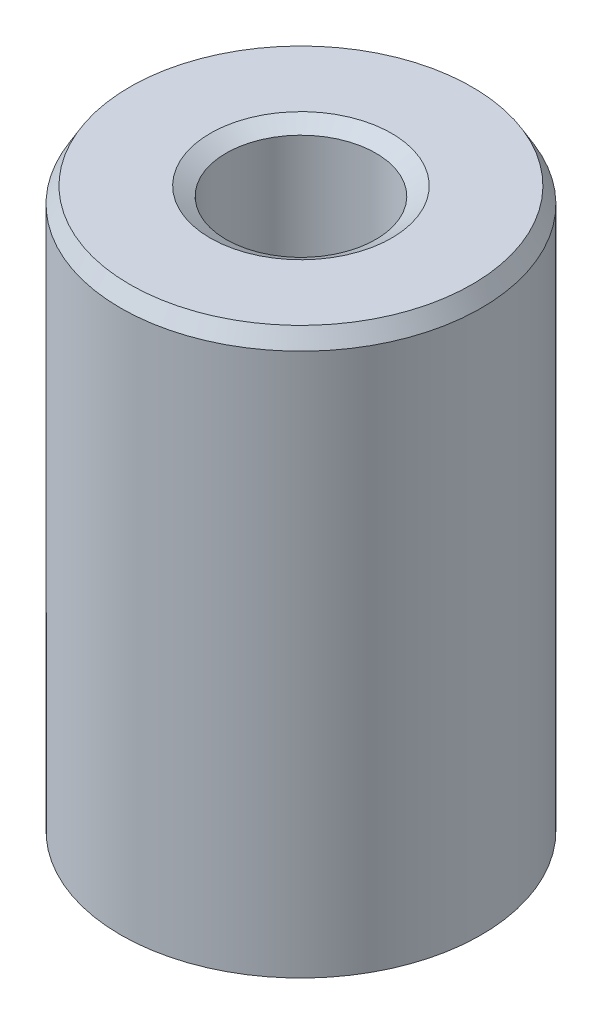
ISO-10303-21;
HEADER;
FILE_DESCRIPTION(('STEP AP214'),'2;1');
FILE_NAME('part.step','',(''),(''),'','','');
FILE_SCHEMA(('AUTOMOTIVE_DESIGN { 1 0 10303 214 1 1 1 1 }'));
ENDSEC;
DATA;
#1=APPLICATION_CONTEXT('core data for automotive mechanical design processes');
#2=APPLICATION_PROTOCOL_DEFINITION('international standard','automotive_design',2000,#1);
#3=PRODUCT_CONTEXT('',#1,'mechanical');
#4=PRODUCT('Part','Part','',(#3));
#5=PRODUCT_RELATED_PRODUCT_CATEGORY('part','',(#4));
#6=PRODUCT_DEFINITION_FORMATION('','',#4);
#7=PRODUCT_DEFINITION_CONTEXT('part definition',#1,'design');
#8=PRODUCT_DEFINITION('design','',#6,#7);
#9=PRODUCT_DEFINITION_SHAPE('','',#8);
#10=(LENGTH_UNIT() NAMED_UNIT(*) SI_UNIT(.MILLI.,.METRE.));
#11=(NAMED_UNIT(*) PLANE_ANGLE_UNIT() SI_UNIT($,.RADIAN.));
#12=(NAMED_UNIT(*) SI_UNIT($,.STERADIAN.) SOLID_ANGLE_UNIT());
#13=UNCERTAINTY_MEASURE_WITH_UNIT(LENGTH_MEASURE(1.E-05),#10,'distance_accuracy_value','');
#14=(GEOMETRIC_REPRESENTATION_CONTEXT(3) GLOBAL_UNCERTAINTY_ASSIGNED_CONTEXT((#13)) GLOBAL_UNIT_ASSIGNED_CONTEXT((#10,
#11,#12)) REPRESENTATION_CONTEXT('',''));
#15=CARTESIAN_POINT('',(0.,0.,0.));
#16=DIRECTION('',(0.,0.,1.));
#17=DIRECTION('',(1.,0.,0.));
#18=AXIS2_PLACEMENT_3D('',#15,#16,#17);
#19=CARTESIAN_POINT('',(0.,39.3767303408291,0.));
#20=DIRECTION('',(0.,-1.,0.));
#21=DIRECTION('',(0.,0.,-1.));
#22=AXIS2_PLACEMENT_3D('',#19,#20,#21);
#23=CYLINDRICAL_SURFACE('',#22,12.5);
#24=CARTESIAN_POINT('',(0.,0.63589369396249,0.));
#25=DIRECTION('',(0.,1.,0.));
#26=DIRECTION('',(0.,0.,1.));
#27=AXIS2_PLACEMENT_3D('',#24,#25,#26);
#28=CIRCLE('',#27,12.5);
#29=CARTESIAN_POINT('',(0.,0.63589369396249,12.5));
#30=VERTEX_POINT('',#29);
#31=EDGE_CURVE('E10',#30,#30,#28,.T.);
#32=ORIENTED_EDGE('',*,*,#31,.T.);
#33=EDGE_LOOP('',(#32));
#34=FACE_BOUND('',#33,.T.);
#35=CARTESIAN_POINT('',(0.,38.2753301546735,0.));
#36=DIRECTION('',(0.,1.,0.));
#37=DIRECTION('',(0.,0.,1.));
#38=AXIS2_PLACEMENT_3D('',#35,#36,#37);
#39=CIRCLE('',#38,12.5);
#40=CARTESIAN_POINT('',(0.,38.2753301546735,12.5));
#41=VERTEX_POINT('',#40);
#42=EDGE_CURVE('E50',#41,#41,#39,.F.);
#43=ORIENTED_EDGE('',*,*,#42,.T.);
#44=EDGE_LOOP('',(#43));
#45=FACE_BOUND('',#44,.T.);
#46=ADVANCED_FACE('F39',(#34,#45),#23,.T.);
#47=CARTESIAN_POINT('',(0.,39.3767303408291,0.));
#48=DIRECTION('',(0.,1.,0.));
#49=DIRECTION('',(0.,0.,1.));
#50=AXIS2_PLACEMENT_3D('',#47,#48,#49);
#51=PLANE('',#50);
#52=CARTESIAN_POINT('',(0.,39.3767303408291,0.));
#53=DIRECTION('',(0.,1.,0.));
#54=DIRECTION('',(0.,0.,1.));
#55=AXIS2_PLACEMENT_3D('',#52,#53,#54);
#56=CIRCLE('',#55,6.29175784586737);
#57=CARTESIAN_POINT('',(0.,39.3767303408291,6.29175784586737));
#58=VERTEX_POINT('',#57);
#59=EDGE_CURVE('E58',#58,#58,#56,.F.);
#60=ORIENTED_EDGE('',*,*,#59,.T.);
#61=EDGE_LOOP('',(#60));
#62=FACE_BOUND('',#61,.T.);
#63=CARTESIAN_POINT('',(0.,39.3767303408291,0.));
#64=DIRECTION('',(0.,1.,0.));
#65=DIRECTION('',(0.,0.,1.));
#66=AXIS2_PLACEMENT_3D('',#63,#64,#65);
#67=CIRCLE('',#66,11.8641063060375);
#68=CARTESIAN_POINT('',(0.,39.3767303408291,11.8641063060375));
#69=VERTEX_POINT('',#68);
#70=EDGE_CURVE('E61',#69,#69,#67,.T.);
#71=ORIENTED_EDGE('',*,*,#70,.T.);
#72=EDGE_LOOP('',(#71));
#73=FACE_BOUND('',#72,.T.);
#74=ADVANCED_FACE('F88',(#62,#73),#51,.T.);
#75=CARTESIAN_POINT('',(0.,0.,0.));
#76=DIRECTION('',(0.,1.,0.));
#77=DIRECTION('',(0.,0.,1.));
#78=AXIS2_PLACEMENT_3D('',#75,#76,#77);
#79=PLANE('',#78);
#80=CARTESIAN_POINT('',(0.,0.,0.));
#81=DIRECTION('',(0.,1.,0.));
#82=DIRECTION('',(0.,0.,1.));
#83=AXIS2_PLACEMENT_3D('',#80,#81,#82);
#84=CIRCLE('',#83,5.82625135367415);
#85=CARTESIAN_POINT('',(0.,0.,5.82625135367415));
#86=VERTEX_POINT('',#85);
#87=EDGE_CURVE('E51',#86,#86,#84,.T.);
#88=ORIENTED_EDGE('',*,*,#87,.T.);
#89=EDGE_LOOP('',(#88));
#90=FACE_BOUND('',#89,.T.);
#91=CARTESIAN_POINT('',(0.,0.,0.));
#92=DIRECTION('',(0.,1.,0.));
#93=DIRECTION('',(0.,0.,1.));
#94=AXIS2_PLACEMENT_3D('',#91,#92,#93);
#95=CIRCLE('',#94,11.3985998138443);
#96=CARTESIAN_POINT('',(0.,0.,11.3985998138443));
#97=VERTEX_POINT('',#96);
#98=EDGE_CURVE('E54',#97,#97,#95,.F.);
#99=ORIENTED_EDGE('',*,*,#98,.T.);
#100=EDGE_LOOP('',(#99));
#101=FACE_BOUND('',#100,.T.);
#102=ADVANCED_FACE('F83',(#90,#101),#79,.F.);
#103=CARTESIAN_POINT('',(0.,39.3767303408291,0.));
#104=DIRECTION('',(0.,-1.,0.));
#105=DIRECTION('',(0.,0.,-1.));
#106=AXIS2_PLACEMENT_3D('',#103,#104,#105);
#107=CYLINDRICAL_SURFACE('',#106,5.19035765971167);
#108=CARTESIAN_POINT('',(0.,38.7408366468667,0.));
#109=DIRECTION('',(0.,1.,0.));
#110=DIRECTION('',(0.,0.,1.));
#111=AXIS2_PLACEMENT_3D('',#108,#109,#110);
#112=CIRCLE('',#111,5.19035765971167);
#113=CARTESIAN_POINT('',(0.,38.7408366468667,5.19035765971167));
#114=VERTEX_POINT('',#113);
#115=EDGE_CURVE('E67',#114,#114,#112,.T.);
#116=ORIENTED_EDGE('',*,*,#115,.T.);
#117=EDGE_LOOP('',(#116));
#118=FACE_BOUND('',#117,.T.);
#119=CARTESIAN_POINT('',(0.,1.10140018615568,0.));
#120=DIRECTION('',(0.,1.,0.));
#121=DIRECTION('',(0.,0.,1.));
#122=AXIS2_PLACEMENT_3D('',#119,#120,#121);
#123=CIRCLE('',#122,5.19035765971167);
#124=CARTESIAN_POINT('',(0.,1.10140018615568,5.19035765971167));
#125=VERTEX_POINT('',#124);
#126=EDGE_CURVE('E69',#125,#125,#123,.F.);
#127=ORIENTED_EDGE('',*,*,#126,.T.);
#128=EDGE_LOOP('',(#127));
#129=FACE_BOUND('',#128,.T.);
#130=ADVANCED_FACE('F71',(#118,#129),#107,.F.);
#131=CARTESIAN_POINT('',(0.,38.7408366468667,0.));
#132=DIRECTION('',(0.,1.,0.));
#133=DIRECTION('',(0.,0.,1.));
#134=AXIS2_PLACEMENT_3D('',#131,#132,#133);
#135=CONICAL_SURFACE('',#134,5.19035765971167,1.0471975511966);
#136=ORIENTED_EDGE('',*,*,#59,.F.);
#137=EDGE_LOOP('',(#136));
#138=FACE_BOUND('',#137,.T.);
#139=ORIENTED_EDGE('',*,*,#115,.F.);
#140=EDGE_LOOP('',(#139));
#141=FACE_BOUND('',#140,.T.);
#142=ADVANCED_FACE('F77',(#138,#141),#135,.F.);
#143=CARTESIAN_POINT('',(0.,0.,0.));
#144=DIRECTION('',(0.,-1.,0.));
#145=DIRECTION('',(0.,0.,-1.));
#146=AXIS2_PLACEMENT_3D('',#143,#144,#145);
#147=CONICAL_SURFACE('',#146,5.82625135367415,0.523598775598297);
#148=ORIENTED_EDGE('',*,*,#126,.F.);
#149=EDGE_LOOP('',(#148));
#150=FACE_BOUND('',#149,.T.);
#151=ORIENTED_EDGE('',*,*,#87,.F.);
#152=EDGE_LOOP('',(#151));
#153=FACE_BOUND('',#152,.T.);
#154=ADVANCED_FACE('F73',(#150,#153),#147,.F.);
#155=CARTESIAN_POINT('',(0.,0.63589369396249,0.));
#156=DIRECTION('',(0.,1.,0.));
#157=DIRECTION('',(0.,0.,1.));
#158=AXIS2_PLACEMENT_3D('',#155,#156,#157);
#159=CONICAL_SURFACE('',#158,12.5,1.0471975511966);
#160=CARTESIAN_POINT('',(0.,0.,11.3985998138443));
#161=CARTESIAN_POINT('',(0.,0.00662389264544255,11.4100727324501));
#162=CARTESIAN_POINT('',(0.,0.0132477852908851,11.4215456510559));
#163=CARTESIAN_POINT('',(0.,0.0264955705817703,11.4444914882675));
#164=CARTESIAN_POINT('',(0.,0.0331194632272129,11.4559644068733));
#165=CARTESIAN_POINT('',(0.,0.0463672485180982,11.4789102440848));
#166=CARTESIAN_POINT('',(0.,0.0529911411635409,11.4903831626906));
#167=CARTESIAN_POINT('',(0.,0.066238926454426,11.5133289999022));
#168=CARTESIAN_POINT('',(0.,0.0728628190998685,11.524801918508));
#169=CARTESIAN_POINT('',(0.,0.0861106043907536,11.5477477557196));
#170=CARTESIAN_POINT('',(0.,0.0927344970361963,11.5592206743254));
#171=CARTESIAN_POINT('',(0.,0.105982282327082,11.5821665115369));
#172=CARTESIAN_POINT('',(0.,0.112606174972524,11.5936394301427));
#173=CARTESIAN_POINT('',(0.,0.125853960263409,11.6165852673543));
#174=CARTESIAN_POINT('',(0.,0.132477852908852,11.6280581859601));
#175=CARTESIAN_POINT('',(0.,0.145725638199737,11.6510040231717));
#176=CARTESIAN_POINT('',(0.,0.15234953084518,11.6624769417774));
#177=CARTESIAN_POINT('',(0.,0.165597316136065,11.685422778989));
#178=CARTESIAN_POINT('',(0.,0.172221208781507,11.6968956975948));
#179=CARTESIAN_POINT('',(0.,0.185468994072393,11.7198415348064));
#180=CARTESIAN_POINT('',(0.,0.192092886717835,11.7313144534122));
#181=CARTESIAN_POINT('',(0.,0.205340672008721,11.7542602906238));
#182=CARTESIAN_POINT('',(0.,0.211964564654163,11.7657332092295));
#183=CARTESIAN_POINT('',(0.,0.225212349945048,11.7886790464411));
#184=CARTESIAN_POINT('',(0.,0.231836242590491,11.8001519650469));
#185=CARTESIAN_POINT('',(0.,0.245084027881376,11.8230978022585));
#186=CARTESIAN_POINT('',(0.,0.251707920526819,11.8345707208643));
#187=CARTESIAN_POINT('',(0.,0.264955705817704,11.8575165580758));
#188=CARTESIAN_POINT('',(0.,0.271579598463147,11.8689894766816));
#189=CARTESIAN_POINT('',(0.,0.284827383754032,11.8919353138932));
#190=CARTESIAN_POINT('',(0.,0.291451276399474,11.903408232499));
#191=CARTESIAN_POINT('',(0.,0.30469906169036,11.9263540697106));
#192=CARTESIAN_POINT('',(0.,0.311322954335802,11.9378269883164));
#193=CARTESIAN_POINT('',(0.,0.324570739626688,11.9607728255279));
#194=CARTESIAN_POINT('',(0.,0.33119463227213,11.9722457441337));
#195=CARTESIAN_POINT('',(0.,0.344442417563015,11.9951915813453));
#196=CARTESIAN_POINT('',(0.,0.351066310208458,12.0066644999511));
#197=CARTESIAN_POINT('',(0.,0.364314095499343,12.0296103371627));
#198=CARTESIAN_POINT('',(0.,0.370937988144786,12.0410832557685));
#199=CARTESIAN_POINT('',(0.,0.384185773435671,12.06402909298));
#200=CARTESIAN_POINT('',(0.,0.390809666081114,12.0755020115858));
#201=CARTESIAN_POINT('',(0.,0.404057451371999,12.0984478487974));
#202=CARTESIAN_POINT('',(0.,0.410681344017441,12.1099207674032));
#203=CARTESIAN_POINT('',(0.,0.423929129308327,12.1328666046148));
#204=CARTESIAN_POINT('',(0.,0.430553021953769,12.1443395232206));
#205=CARTESIAN_POINT('',(0.,0.443800807244654,12.1672853604321));
#206=CARTESIAN_POINT('',(0.,0.450424699890097,12.1787582790379));
#207=CARTESIAN_POINT('',(0.,0.463672485180982,12.2017041162495));
#208=CARTESIAN_POINT('',(0.,0.470296377826425,12.2131770348553));
#209=CARTESIAN_POINT('',(0.,0.48354416311731,12.2361228720669));
#210=CARTESIAN_POINT('',(0.,0.490168055762753,12.2475957906727));
#211=CARTESIAN_POINT('',(0.,0.503415841053638,12.2705416278842));
#212=CARTESIAN_POINT('',(0.,0.51003973369908,12.28201454649));
#213=CARTESIAN_POINT('',(0.,0.523287518989966,12.3049603837016));
#214=CARTESIAN_POINT('',(0.,0.529911411635408,12.3164333023074));
#215=CARTESIAN_POINT('',(0.,0.543159196926294,12.339379139519));
#216=CARTESIAN_POINT('',(0.,0.549783089571736,12.3508520581248));
#217=CARTESIAN_POINT('',(0.,0.563030874862621,12.3737978953363));
#218=CARTESIAN_POINT('',(0.,0.569654767508064,12.3852708139421));
#219=CARTESIAN_POINT('',(0.,0.582902552798949,12.4082166511537));
#220=CARTESIAN_POINT('',(0.,0.589526445444392,12.4196895697595));
#221=CARTESIAN_POINT('',(0.,0.602774230735277,12.4426354069711));
#222=CARTESIAN_POINT('',(0.,0.60939812338072,12.4541083255768));
#223=CARTESIAN_POINT('',(0.,0.622645908671605,12.4770541627884));
#224=CARTESIAN_POINT('',(0.,0.629269801317048,12.4885270813942));
#225=CARTESIAN_POINT('',(0.,0.63589369396249,12.5));
#226=B_SPLINE_CURVE_WITH_KNOTS('',3,(#160,#161,#162,#163,#164,#165,#166,#167,#168,#169,#170,
#171,#172,#173,#174,#175,#176,#177,#178,#179,#180,#181,#182,#183,#184,#185,#186,#187,#188,#189,
#190,#191,#192,#193,#194,#195,#196,#197,#198,#199,#200,#201,#202,#203,#204,#205,#206,#207,#208,
#209,#210,#211,#212,#213,#214,#215,#216,#217,#218,#219,#220,#221,#222,#223,#224,#225),
.UNSPECIFIED.,.F.,.F.,(4,2,2,2,2,2,2,2,2,2,2,2,2,2,2,2,2,2,2,2,2,2,2,2,2,2,2,2,2,2,2,2,4),(0.,
0.0397433558726553,0.0794867117453107,0.119230067617966,0.158973423490623,0.198716779363278,
0.238460135235934,0.278203491108589,0.317946846981244,0.357690202853901,0.397433558726556,
0.437176914599212,0.476920270471867,0.516663626344522,0.556406982217178,0.596150338089835,
0.63589369396249,0.675637049835145,0.7153804057078,0.755123761580456,0.794867117453113,
0.834610473325768,0.874353829198423,0.914097185071079,0.953840540943734,0.993583896816391,
1.03332725268905,1.0730706085617,1.11281396443436,1.15255732030701,1.19230067617967,
1.23204403205232,1.27178738792498),.UNSPECIFIED.);
#227=EDGE_CURVE('BSEAM76',#97,#30,#226,.T.);
#228=ORIENTED_EDGE('',*,*,#98,.F.);
#229=ORIENTED_EDGE('',*,*,#31,.F.);
#230=ORIENTED_EDGE('',*,*,#227,.T.);
#231=ORIENTED_EDGE('',*,*,#227,.F.);
#232=EDGE_LOOP('',(#228,#230,#229,#231));
#233=FACE_BOUND('',#232,.T.);
#234=ADVANCED_FACE('F76',(#233),#159,.T.);
#235=CARTESIAN_POINT('',(0.,39.3767303408291,0.));
#236=DIRECTION('',(0.,-1.,0.));
#237=DIRECTION('',(0.,0.,-1.));
#238=AXIS2_PLACEMENT_3D('',#235,#236,#237);
#239=CONICAL_SURFACE('',#238,11.8641063060375,0.523598775598296);
#240=ORIENTED_EDGE('',*,*,#42,.F.);
#241=EDGE_LOOP('',(#240));
#242=FACE_BOUND('',#241,.T.);
#243=ORIENTED_EDGE('',*,*,#70,.F.);
#244=EDGE_LOOP('',(#243));
#245=FACE_BOUND('',#244,.T.);
#246=ADVANCED_FACE('F45',(#242,#245),#239,.T.);
#247=CLOSED_SHELL('',(#46,#74,#102,#130,#142,#154,#234,#246));
#248=MANIFOLD_SOLID_BREP('B2',#247);
#249=ADVANCED_BREP_SHAPE_REPRESENTATION('',(#18,#248),#14);
#250=SHAPE_DEFINITION_REPRESENTATION(#9,#249);
ENDSEC;
END-ISO-10303-21;
